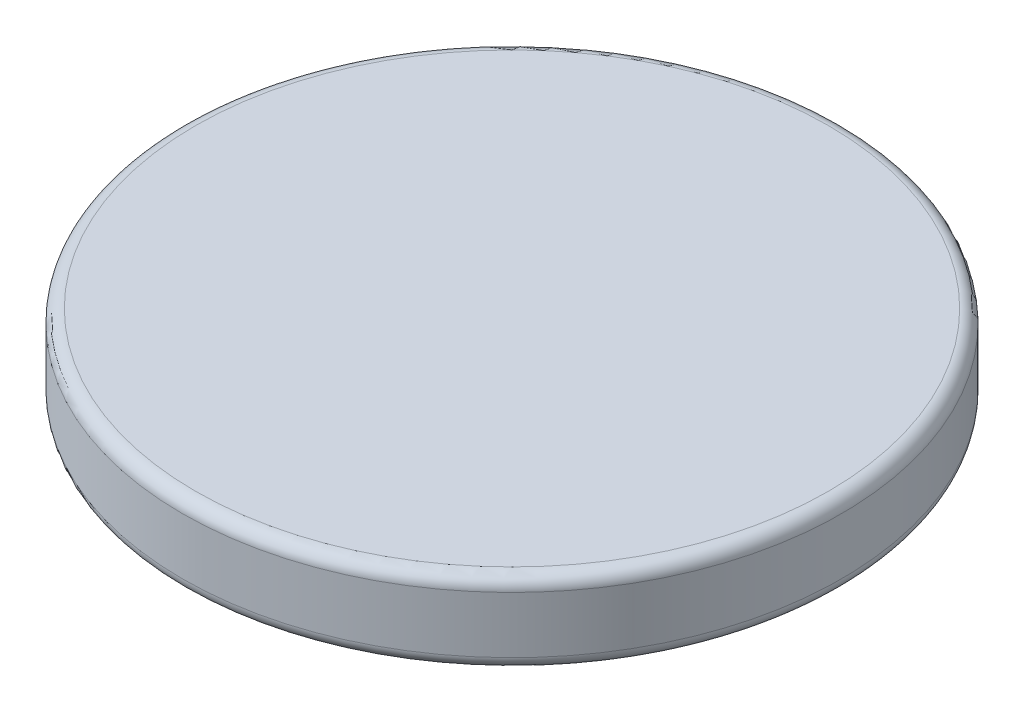
ISO-10303-21;
HEADER;
FILE_DESCRIPTION(('STEP AP214'),'2;1');
FILE_NAME('part.step','',(''),(''),'','','');
FILE_SCHEMA(('AUTOMOTIVE_DESIGN { 1 0 10303 214 1 1 1 1 }'));
ENDSEC;
DATA;
#1=APPLICATION_CONTEXT('core data for automotive mechanical design processes');
#2=APPLICATION_PROTOCOL_DEFINITION('international standard','automotive_design',2000,#1);
#3=PRODUCT_CONTEXT('',#1,'mechanical');
#4=PRODUCT('Part','Part','',(#3));
#5=PRODUCT_RELATED_PRODUCT_CATEGORY('part','',(#4));
#6=PRODUCT_DEFINITION_FORMATION('','',#4);
#7=PRODUCT_DEFINITION_CONTEXT('part definition',#1,'design');
#8=PRODUCT_DEFINITION('design','',#6,#7);
#9=PRODUCT_DEFINITION_SHAPE('','',#8);
#10=(LENGTH_UNIT() NAMED_UNIT(*) SI_UNIT(.MILLI.,.METRE.));
#11=(NAMED_UNIT(*) PLANE_ANGLE_UNIT() SI_UNIT($,.RADIAN.));
#12=(NAMED_UNIT(*) SI_UNIT($,.STERADIAN.) SOLID_ANGLE_UNIT());
#13=UNCERTAINTY_MEASURE_WITH_UNIT(LENGTH_MEASURE(1.E-05),#10,'distance_accuracy_value','');
#14=(GEOMETRIC_REPRESENTATION_CONTEXT(3) GLOBAL_UNCERTAINTY_ASSIGNED_CONTEXT((#13)) GLOBAL_UNIT_ASSIGNED_CONTEXT((#10,
#11,#12)) REPRESENTATION_CONTEXT('',''));
#15=CARTESIAN_POINT('',(0.,0.,0.));
#16=DIRECTION('',(0.,0.,1.));
#17=DIRECTION('',(1.,0.,0.));
#18=AXIS2_PLACEMENT_3D('',#15,#16,#17);
#19=CARTESIAN_POINT('',(0.,1.5875,0.));
#20=DIRECTION('',(0.,-1.,0.));
#21=DIRECTION('',(0.,0.,-1.));
#22=AXIS2_PLACEMENT_3D('',#19,#20,#21);
#23=CYLINDRICAL_SURFACE('',#22,6.35);
#24=CARTESIAN_POINT('',(0.,0.25,0.));
#25=DIRECTION('',(0.,1.,0.));
#26=DIRECTION('',(0.,0.,1.));
#27=AXIS2_PLACEMENT_3D('',#24,#25,#26);
#28=CIRCLE('',#27,6.35);
#29=CARTESIAN_POINT('',(0.,0.25,6.35));
#30=VERTEX_POINT('',#29);
#31=EDGE_CURVE('E43',#30,#30,#28,.T.);
#32=ORIENTED_EDGE('',*,*,#31,.T.);
#33=EDGE_LOOP('',(#32));
#34=FACE_BOUND('',#33,.T.);
#35=CARTESIAN_POINT('',(0.,1.3375,0.));
#36=DIRECTION('',(0.,1.,0.));
#37=DIRECTION('',(0.,0.,1.));
#38=AXIS2_PLACEMENT_3D('',#35,#36,#37);
#39=CIRCLE('',#38,6.35);
#40=CARTESIAN_POINT('',(0.,1.3375,6.35));
#41=VERTEX_POINT('',#40);
#42=EDGE_CURVE('E47',#41,#41,#39,.F.);
#43=ORIENTED_EDGE('',*,*,#42,.T.);
#44=EDGE_LOOP('',(#43));
#45=FACE_BOUND('',#44,.T.);
#46=ADVANCED_FACE('F32',(#34,#45),#23,.T.);
#47=CARTESIAN_POINT('',(0.,1.5875,0.));
#48=DIRECTION('',(0.,1.,0.));
#49=DIRECTION('',(0.,0.,1.));
#50=AXIS2_PLACEMENT_3D('',#47,#48,#49);
#51=PLANE('',#50);
#52=CARTESIAN_POINT('',(0.,1.5875,0.));
#53=DIRECTION('',(0.,1.,0.));
#54=DIRECTION('',(0.,0.,1.));
#55=AXIS2_PLACEMENT_3D('',#52,#53,#54);
#56=CIRCLE('',#55,6.1);
#57=CARTESIAN_POINT('',(0.,1.5875,6.1));
#58=VERTEX_POINT('',#57);
#59=EDGE_CURVE('E10',#58,#58,#56,.T.);
#60=ORIENTED_EDGE('',*,*,#59,.T.);
#61=EDGE_LOOP('',(#60));
#62=FACE_BOUND('',#61,.T.);
#63=ADVANCED_FACE('F63',(#62),#51,.T.);
#64=CARTESIAN_POINT('',(0.,0.,0.));
#65=DIRECTION('',(0.,1.,0.));
#66=DIRECTION('',(0.,0.,1.));
#67=AXIS2_PLACEMENT_3D('',#64,#65,#66);
#68=PLANE('',#67);
#69=CARTESIAN_POINT('',(0.,0.,0.));
#70=DIRECTION('',(0.,1.,0.));
#71=DIRECTION('',(0.,0.,1.));
#72=AXIS2_PLACEMENT_3D('',#69,#70,#71);
#73=CIRCLE('',#72,6.1);
#74=CARTESIAN_POINT('',(0.,0.,6.1));
#75=VERTEX_POINT('',#74);
#76=EDGE_CURVE('E39',#75,#75,#73,.F.);
#77=ORIENTED_EDGE('',*,*,#76,.T.);
#78=EDGE_LOOP('',(#77));
#79=FACE_BOUND('',#78,.T.);
#80=ADVANCED_FACE('F60',(#79),#68,.F.);
#81=CARTESIAN_POINT('',(0.,0.25,0.));
#82=DIRECTION('',(0.,1.,0.));
#83=DIRECTION('',(0.,0.,1.));
#84=AXIS2_PLACEMENT_3D('',#81,#82,#83);
#85=TOROIDAL_SURFACE('',#84,6.1,0.25);
#86=ORIENTED_EDGE('',*,*,#76,.F.);
#87=EDGE_LOOP('',(#86));
#88=FACE_BOUND('',#87,.T.);
#89=ORIENTED_EDGE('',*,*,#31,.F.);
#90=EDGE_LOOP('',(#89));
#91=FACE_BOUND('',#90,.T.);
#92=ADVANCED_FACE('F56',(#88,#91),#85,.T.);
#93=CARTESIAN_POINT('',(0.,1.3375,0.));
#94=DIRECTION('',(0.,1.,0.));
#95=DIRECTION('',(0.,0.,1.));
#96=AXIS2_PLACEMENT_3D('',#93,#94,#95);
#97=TOROIDAL_SURFACE('',#96,6.1,0.25);
#98=ORIENTED_EDGE('',*,*,#42,.F.);
#99=EDGE_LOOP('',(#98));
#100=FACE_BOUND('',#99,.T.);
#101=ORIENTED_EDGE('',*,*,#59,.F.);
#102=EDGE_LOOP('',(#101));
#103=FACE_BOUND('',#102,.T.);
#104=ADVANCED_FACE('F34',(#100,#103),#97,.T.);
#105=CLOSED_SHELL('',(#46,#63,#80,#92,#104));
#106=MANIFOLD_SOLID_BREP('B2',#105);
#107=ADVANCED_BREP_SHAPE_REPRESENTATION('',(#18,#106),#14);
#108=SHAPE_DEFINITION_REPRESENTATION(#9,#107);
ENDSEC;
END-ISO-10303-21;
